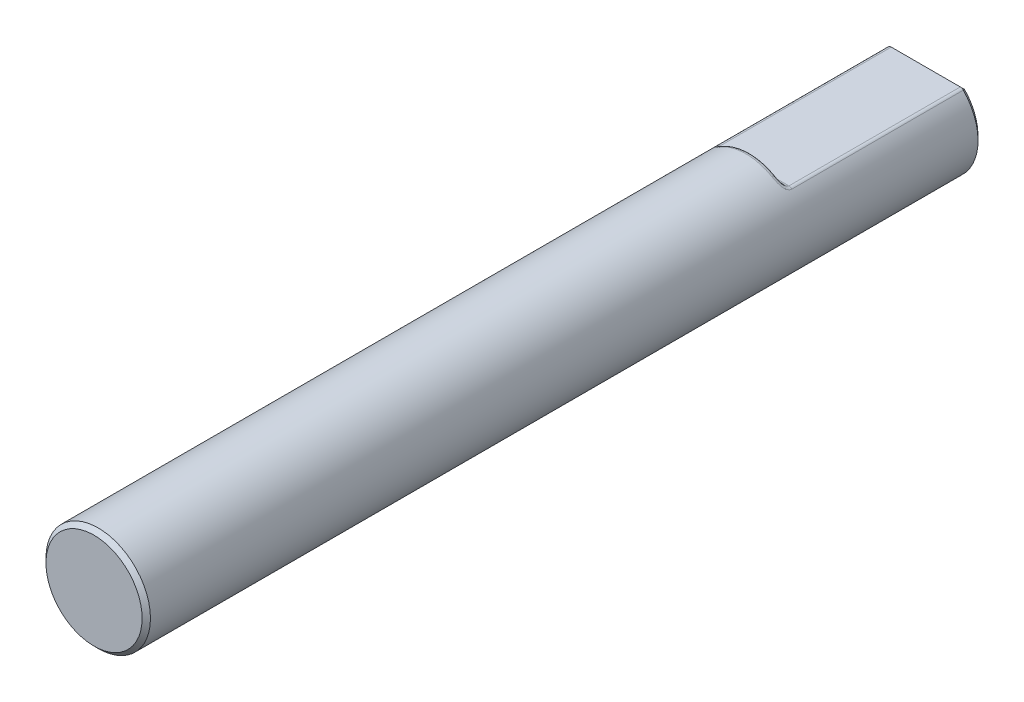
ISO-10303-21;
HEADER;
FILE_DESCRIPTION(('STEP AP214'),'2;1');
FILE_NAME('part.step','',(''),(''),'','','');
FILE_SCHEMA(('AUTOMOTIVE_DESIGN { 1 0 10303 214 1 1 1 1 }'));
ENDSEC;
DATA;
#1=APPLICATION_CONTEXT('core data for automotive mechanical design processes');
#2=APPLICATION_PROTOCOL_DEFINITION('international standard','automotive_design',2000,#1);
#3=PRODUCT_CONTEXT('',#1,'mechanical');
#4=PRODUCT('Part','Part','',(#3));
#5=PRODUCT_RELATED_PRODUCT_CATEGORY('part','',(#4));
#6=PRODUCT_DEFINITION_FORMATION('','',#4);
#7=PRODUCT_DEFINITION_CONTEXT('part definition',#1,'design');
#8=PRODUCT_DEFINITION('design','',#6,#7);
#9=PRODUCT_DEFINITION_SHAPE('','',#8);
#10=(LENGTH_UNIT() NAMED_UNIT(*) SI_UNIT(.MILLI.,.METRE.));
#11=(NAMED_UNIT(*) PLANE_ANGLE_UNIT() SI_UNIT($,.RADIAN.));
#12=(NAMED_UNIT(*) SI_UNIT($,.STERADIAN.) SOLID_ANGLE_UNIT());
#13=UNCERTAINTY_MEASURE_WITH_UNIT(LENGTH_MEASURE(1.E-05),#10,'distance_accuracy_value','');
#14=(GEOMETRIC_REPRESENTATION_CONTEXT(3) GLOBAL_UNCERTAINTY_ASSIGNED_CONTEXT((#13)) GLOBAL_UNIT_ASSIGNED_CONTEXT((#10,
#11,#12)) REPRESENTATION_CONTEXT('',''));
#15=CARTESIAN_POINT('',(0.,0.,0.));
#16=DIRECTION('',(0.,0.,1.));
#17=DIRECTION('',(1.,0.,0.));
#18=AXIS2_PLACEMENT_3D('',#15,#16,#17);
#19=CARTESIAN_POINT('',(0.,0.,50.8));
#20=DIRECTION('',(0.,0.,-1.));
#21=DIRECTION('',(-1.,0.,0.));
#22=AXIS2_PLACEMENT_3D('',#19,#20,#21);
#23=CYLINDRICAL_SURFACE('',#22,3.175);
#24=CARTESIAN_POINT('',(0.,0.,0.254000000000004));
#25=DIRECTION('',(0.,0.,1.));
#26=DIRECTION('',(1.,0.,0.));
#27=AXIS2_PLACEMENT_3D('',#24,#25,#26);
#28=CIRCLE('',#27,3.175);
#29=CARTESIAN_POINT('',(-2.28085258534348,2.20869565217391,0.254000000000004));
#30=VERTEX_POINT('',#29);
#31=CARTESIAN_POINT('',(2.28085258534348,2.20869565217391,0.254000000000004));
#32=VERTEX_POINT('',#31);
#33=EDGE_CURVE('E129',#30,#32,#28,.T.);
#34=ORIENTED_EDGE('',*,*,#33,.T.);
#35=DIRECTION('',(0.,0.,-1.));
#36=VECTOR('',#35,1.);
#37=CARTESIAN_POINT('',(2.28085258534348,2.20869565217391,50.8));
#38=LINE('',#37,#36);
#39=CARTESIAN_POINT('',(2.28085258534348,2.20869565217391,10.668));
#40=VERTEX_POINT('',#39);
#41=EDGE_CURVE('E229',#32,#40,#38,.F.);
#42=ORIENTED_EDGE('',*,*,#41,.T.);
#43=CARTESIAN_POINT('',(2.08147708691296,2.29465776440921,10.6022490499284));
#44=CARTESIAN_POINT('',(2.18936386379474,2.3017755032168,10.5756900123859));
#45=CARTESIAN_POINT('',(2.26247509447061,2.22751687915046,10.5364980998569));
#46=CARTESIAN_POINT('',(2.08704213800368,2.29182579741401,10.6127352009054));
#47=CARTESIAN_POINT('',(2.19483382835522,2.29661405397611,10.5902415242961));
#48=CARTESIAN_POINT('',(2.2685240630427,2.22136042915325,10.557470401812));
#49=CARTESIAN_POINT('',(2.09127161059837,2.28966018443801,10.6235854112991));
#50=CARTESIAN_POINT('',(2.19899567678026,2.29266629177763,10.6054541841004));
#51=CARTESIAN_POINT('',(2.2731213158654,2.21665257486143,10.5791708225988));
#52=CARTESIAN_POINT('',(2.09693841074738,2.28674969284816,10.6456238485392));
#53=CARTESIAN_POINT('',(2.20456628068673,2.28736847128426,10.6364319540538));
#54=CARTESIAN_POINT('',(2.27928088124954,2.21032541923893,10.6232476970779));
#55=CARTESIAN_POINT('',(2.09838256951604,2.28600133837143,10.6568111798799));
#56=CARTESIAN_POINT('',(2.20599150026584,2.28600284201359,10.6522216219));
#57=CARTESIAN_POINT('',(2.28085061904393,2.20869856168462,10.6456223597587));
#58=CARTESIAN_POINT('',(2.09838619099479,2.2859986590548,10.6792103368978));
#59=CARTESIAN_POINT('',(2.2059961718689,2.28599715252333,10.6838087081969));
#60=CARTESIAN_POINT('',(2.28085455542436,2.20869273706804,10.6904206737969));
#61=CARTESIAN_POINT('',(2.09694010091918,2.28674721009179,10.6904221683066));
#62=CARTESIAN_POINT('',(2.20457015007853,2.2873623338206,10.6996346421608));
#63=CARTESIAN_POINT('',(2.27928271837372,2.21032002191199,10.7128443366173));
#64=CARTESIAN_POINT('',(2.09124508751864,2.28967543925533,10.7124646912369));
#65=CARTESIAN_POINT('',(2.19896732211511,2.29269574713314,10.7306144268907));
#66=CARTESIAN_POINT('',(2.27309248644999,2.21668573753827,10.7569293824697));
#67=CARTESIAN_POINT('',(2.08699720571866,2.29185458557769,10.7232955228144));
#68=CARTESIAN_POINT('',(2.19478164244558,2.29667240400907,10.7457947946078));
#69=CARTESIAN_POINT('',(2.26847522366919,2.22142301222448,10.7785910456132));
#70=CARTESIAN_POINT('',(2.07595044465018,2.2974642569809,10.7442187468032));
#71=CARTESIAN_POINT('',(2.18392059477765,2.3069026139896,10.7748934919265));
#72=CARTESIAN_POINT('',(2.25646787455811,2.23361794985989,10.8204374936219));
#73=CARTESIAN_POINT('',(2.06916417277795,2.30088859527619,10.7543144988638));
#74=CARTESIAN_POINT('',(2.17723960723695,2.31316155570918,10.7888379839697));
#75=CARTESIAN_POINT('',(2.24909149192047,2.24106216327694,10.8406289977851));
#76=CARTESIAN_POINT('',(2.0533390852713,2.30876903921047,10.773628356883));
#77=CARTESIAN_POINT('',(2.16169366957577,2.32756298714666,10.8152092608687));
#78=CARTESIAN_POINT('',(2.23189030987301,2.25819356319842,10.8792567137962));
#79=CARTESIAN_POINT('',(2.04429730681642,2.31322650140487,10.7828452862371));
#80=CARTESIAN_POINT('',(2.15280269495554,2.33572867882211,10.8276462834935));
#81=CARTESIAN_POINT('',(2.22206229000665,2.2678836987371,10.8976905724349));
#82=CARTESIAN_POINT('',(2.02098081459409,2.32454002169663,10.8031634616703));
#83=CARTESIAN_POINT('',(2.1298989593879,2.35648115888799,10.8546466238543));
#84=CARTESIAN_POINT('',(2.19671827674762,2.29247830799507,10.938326923393));
#85=CARTESIAN_POINT('',(2.00596415863645,2.33170199441288,10.813881232634));
#86=CARTESIAN_POINT('',(2.1151434144868,2.36965333032366,10.8685247619315));
#87=CARTESIAN_POINT('',(2.18039582431238,2.30804781321404,10.9597624655657));
#88=CARTESIAN_POINT('',(1.97326577194165,2.34691281321471,10.8334930249975));
#89=CARTESIAN_POINT('',(2.08311483966224,2.39764310925851,10.8931020085138));
#90=CARTESIAN_POINT('',(2.14485409958122,2.34111481049926,10.9989860503166));
#91=CARTESIAN_POINT('',(1.95558163307324,2.35496245888326,10.8423853811602));
#92=CARTESIAN_POINT('',(2.06577703049759,2.41251048062678,10.9037877300662));
#93=CARTESIAN_POINT('',(2.12563220975182,2.35861404079051,11.0167707624204));
#94=CARTESIAN_POINT('',(1.91032606273425,2.37500469820587,10.8618052326057));
#95=CARTESIAN_POINT('',(2.02141535496309,2.44966648524454,10.9260146682914));
#96=CARTESIAN_POINT('',(2.07644137269369,2.40218412690304,11.0556104650698));
#97=CARTESIAN_POINT('',(1.88170767927852,2.38724120258011,10.8714671427826));
#98=CARTESIAN_POINT('',(1.99339768762638,2.47241543279391,10.9359028621589));
#99=CARTESIAN_POINT('',(2.04533443404104,2.4287852231007,11.0749342855267));
#100=CARTESIAN_POINT('',(1.82145126386168,2.41193885149924,10.8878579904839));
#101=CARTESIAN_POINT('',(1.93465543768717,2.51841820597802,10.9503739619204));
#102=CARTESIAN_POINT('',(1.97983833024153,2.48247576402772,11.1077159810065));
#103=CARTESIAN_POINT('',(1.78979611129448,2.42440090432795,10.8945689447679));
#104=CARTESIAN_POINT('',(1.90377328533236,2.54174707416492,10.9548168710213));
#105=CARTESIAN_POINT('',(1.94543055574109,2.50956718328915,11.1211378895483));
#106=CARTESIAN_POINT('',(1.70409217638077,2.45666350882904,10.9089348463087));
#107=CARTESIAN_POINT('',(1.81979372229936,2.60279896998063,10.960526783035));
#108=CARTESIAN_POINT('',(1.85227410478405,2.57970328011575,11.1498696925971));
#109=CARTESIAN_POINT('',(1.64833733543608,2.47621882415351,10.9145911135186));
#110=CARTESIAN_POINT('',(1.76548834456065,2.63980149990928,10.9576094400363));
#111=CARTESIAN_POINT('',(1.79167101678277,2.62221483512674,11.1611822270332));
#112=CARTESIAN_POINT('',(1.56287100562141,2.50397956699597,10.9196032814114));
#113=CARTESIAN_POINT('',(1.68382821837137,2.69197404713464,10.9467039697256));
#114=CARTESIAN_POINT('',(1.69877283219501,2.68256427607308,11.1712065628248));
#115=CARTESIAN_POINT('',(1.53434399991067,2.51289692220619,10.9207005582209));
#116=CARTESIAN_POINT('',(1.65623483168212,2.7090034987996,10.941891607098));
#117=CARTESIAN_POINT('',(1.66776521729313,2.70194983088047,11.1734011164429));
#118=CARTESIAN_POINT('',(1.47671654123674,2.5302250521972,10.921959105407));
#119=CARTESIAN_POINT('',(1.60056792251028,2.74223967470831,10.9302836248005));
#120=CARTESIAN_POINT('',(1.6051266752584,2.73961967869211,11.1759182108129));
#121=CARTESIAN_POINT('',(1.44761812910635,2.53863730506082,10.9221232532304));
#122=CARTESIAN_POINT('',(1.57245677980513,2.75844154181662,10.9234337887686));
#123=CARTESIAN_POINT('',(1.5734979664221,2.75790718491991,11.1762465064588));
#124=CARTESIAN_POINT('',(1.41823541644457,2.54679768400697,10.9219090220771));
#125=CARTESIAN_POINT('',(1.54451470751985,2.774006261644,10.9158261656988));
#126=CARTESIAN_POINT('',(1.54156023526584,2.7756471391456,11.1758180441542));
#127=(BOUNDED_SURFACE() B_SPLINE_SURFACE(3,2,((#43,#44,#45),(#46,#47,#48),(#49,#50,#51),(#52,
#53,#54),(#55,#56,#57),(#58,#59,#60),(#61,#62,#63),(#64,#65,#66),(#67,#68,#69),(#70,#71,#72),
(#73,#74,#75),(#76,#77,#78),(#79,#80,#81),(#82,#83,#84),(#85,#86,#87),(#88,#89,#90),(#91,#92,
#93),(#94,#95,#96),(#97,#98,#99),(#100,#101,#102),(#103,#104,#105),(#106,#107,#108),(#109,#110,
#111),(#112,#113,#114),(#115,#116,#117),(#118,#119,#120),(#121,#122,#123),(#124,#125,#126)),
.UNSPECIFIED.,.F.,.F.,.F.) B_SPLINE_SURFACE_WITH_KNOTS((4,2,2,2,2,2,2,2,2,2,2,2,2,4),(3,3),(0.,
0.0672104314705853,0.134255813086062,0.201430127025273,0.26857948396257,0.335399666159644,
0.402308089484164,0.491321385718032,0.580415527083602,0.706679723053762,0.833703060250032,
1.03955425802727,1.14065716571275,1.24144813718876),(0.,1.),
.UNSPECIFIED.) GEOMETRIC_REPRESENTATION_ITEM() RATIONAL_B_SPLINE_SURFACE(((1.,0.9158783432604,
1.),(1.,0.91749680132151,1.),(1.,0.918721732551247,1.),(1.,0.920359514561852,1.),(1.,
0.92077435219615,1.),(1.,0.920775090647766,1.),(1.,0.920359395835313,1.),(1.,0.91871468096907,
1.),(1.,0.917485963144106,1.),(1.,0.914268823994684,1.),(1.,0.912284156361139,1.),(1.,
0.907617155420817,1.),(1.,0.904933904254616,1.),(1.,0.897949439882381,1.),(1.,0.89340656300735,
1.),(1.,0.883384768646523,1.),(1.,0.877905004761794,1.),(1.,0.863707190237002,1.),(1.,
0.854591910951541,1.),(1.,0.835110248016913,1.),(1.,0.824736671822701,1.),(1.,0.796321963359922,
1.),(1.,0.777517554435384,1.),(1.,0.748410149790813,1.),(1.,0.738650250939946,1.),(1.,
0.718888204715718,1.),(1.,0.708886897667141,1.),(1.,0.69878597142492,1.))) REPRESENTATION_ITEM('') SURFACE());
#128=CARTESIAN_POINT('',(1.54156023526584,2.7756471391456,11.1758180441542));
#129=CARTESIAN_POINT('',(1.5734979664221,2.75790718491991,11.1762465064588));
#130=CARTESIAN_POINT('',(1.6051266752584,2.73961967869211,11.1759182108129));
#131=CARTESIAN_POINT('',(1.66776521729313,2.70194983088047,11.1734011164429));
#132=CARTESIAN_POINT('',(1.69877283219501,2.68256427607308,11.1712065628248));
#133=CARTESIAN_POINT('',(1.79167101678277,2.62221483512674,11.1611822270332));
#134=CARTESIAN_POINT('',(1.85227410478405,2.57970328011575,11.1498696925971));
#135=CARTESIAN_POINT('',(1.94543055574109,2.50956718328915,11.1211378895483));
#136=CARTESIAN_POINT('',(1.97983833024153,2.48247576402772,11.1077159810065));
#137=CARTESIAN_POINT('',(2.04533443404104,2.4287852231007,11.0749342855267));
#138=CARTESIAN_POINT('',(2.07644137269369,2.40218412690304,11.0556104650698));
#139=CARTESIAN_POINT('',(2.12563220975182,2.35861404079051,11.0167707624204));
#140=CARTESIAN_POINT('',(2.14485409958122,2.34111481049926,10.9989860503166));
#141=CARTESIAN_POINT('',(2.18039582431238,2.30804781321404,10.9597624655657));
#142=CARTESIAN_POINT('',(2.19671827674762,2.29247830799507,10.938326923393));
#143=CARTESIAN_POINT('',(2.22206229000665,2.2678836987371,10.8976905724349));
#144=CARTESIAN_POINT('',(2.23189030987301,2.25819356319842,10.8792567137962));
#145=CARTESIAN_POINT('',(2.24909149192047,2.24106216327694,10.8406289977851));
#146=CARTESIAN_POINT('',(2.25646787455811,2.23361794985989,10.8204374936219));
#147=CARTESIAN_POINT('',(2.26847522366919,2.22142301222448,10.7785910456132));
#148=CARTESIAN_POINT('',(2.27309248644999,2.21668573753827,10.7569293824697));
#149=CARTESIAN_POINT('',(2.27928271837372,2.21032002191199,10.7128443366173));
#150=CARTESIAN_POINT('',(2.28085455542436,2.20869273706804,10.6904206737969));
#151=CARTESIAN_POINT('',(2.28085061904392,2.20869856168462,10.6456223597587));
#152=CARTESIAN_POINT('',(2.27928088124954,2.21032541923893,10.6232476970779));
#153=CARTESIAN_POINT('',(2.27312131586541,2.21665257486143,10.5791708225988));
#154=CARTESIAN_POINT('',(2.2685240630427,2.22136042915325,10.557470401812));
#155=CARTESIAN_POINT('',(2.26247509447061,2.22751687915046,10.5364980998569));
#156=B_SPLINE_CURVE_WITH_KNOTS('',3,(#128,#129,#130,#131,#132,#133,#134,#135,#136,#137,#138,
#139,#140,#141,#142,#143,#144,#145,#146,#147,#148,#149,#150,#151,#152,#153,#154,#155),
.UNSPECIFIED.,.F.,.F.,(4,2,2,2,2,2,2,2,2,2,2,2,2,4),(0.,0.100790971476017,0.201893879161491,
0.407745076938732,0.534768414135002,0.661032610105162,0.750126751470732,0.8391400477046,
0.90604847102912,0.972868653226194,1.04001801016349,1.1071923241027,1.17423770571818,
1.24144813718876),.UNSPECIFIED.);
#157=CARTESIAN_POINT('',(1.56787252156188,2.76086956521513,11.176));
#158=VERTEX_POINT('',#157);
#159=EDGE_CURVE('E240',#158,#40,#156,.T.);
#160=ORIENTED_EDGE('',*,*,#159,.F.);
#161=CARTESIAN_POINT('',(0.,0.,11.176));
#162=DIRECTION('',(0.,0.,-1.));
#163=DIRECTION('',(-1.,0.,0.));
#164=AXIS2_PLACEMENT_3D('',#161,#162,#163);
#165=CIRCLE('',#164,3.175);
#166=CARTESIAN_POINT('',(-1.56787252156188,2.76086956521513,11.176));
#167=VERTEX_POINT('',#166);
#168=EDGE_CURVE('E285',#158,#167,#165,.F.);
#169=ORIENTED_EDGE('',*,*,#168,.T.);
#170=CARTESIAN_POINT('',(-0.762299234663434,2.67988837118684,10.8800076498778));
#171=CARTESIAN_POINT('',(-0.808454571196122,2.79883353609913,10.8015244187787));
#172=CARTESIAN_POINT('',(-0.830789738447543,2.92858721756073,10.8729597557011));
#173=CARTESIAN_POINT('',(-0.853124905698965,3.05834089902232,10.9443950926236));
#174=CARTESIAN_POINT('',(-0.828586124634168,3.0649747199714,11.0920152997555));
#175=CARTESIAN_POINT('',(-0.820250640114377,2.67205322069554,10.8851771222936));
#176=CARTESIAN_POINT('',(-0.867400480829563,2.79068636588262,10.8131719532479));
#177=CARTESIAN_POINT('',(-0.891541388471028,2.91580560722968,10.8856211442746));
#178=CARTESIAN_POINT('',(-0.914941398498865,3.04107868495901,10.9578892221924));
#179=CARTESIAN_POINT('',(-0.891576782731473,3.0479417841744,11.1023542448926));
#180=CARTESIAN_POINT('',(-0.877755361083727,2.66332341056633,10.8903129678));
#181=CARTESIAN_POINT('',(-0.92592877967618,2.78124472770227,10.8250620211124));
#182=CARTESIAN_POINT('',(-0.951425199159079,2.90151226555305,10.8983450372317));
#183=CARTESIAN_POINT('',(-0.976208377398107,3.02196998343128,10.9714725289282));
#184=CARTESIAN_POINT('',(-0.954081914220675,3.02896393604052,11.1126259357527));
#185=CARTESIAN_POINT('',(-0.991969683185946,2.64403509309197,10.8999690081169));
#186=CARTESIAN_POINT('',(-1.04169258045847,2.75960112540079,10.8482913709519));
#187=CARTESIAN_POINT('',(-1.06978127919812,2.86978499003571,10.9229611074155));
#188=CARTESIAN_POINT('',(-1.09718697316803,2.98015295286698,10.9974959142075));
#189=CARTESIAN_POINT('',(-1.07822791650723,2.98703281104265,11.1319380160807));
#190=CARTESIAN_POINT('',(-1.04867563922458,2.63347006104244,10.9044868998619));
#191=CARTESIAN_POINT('',(-1.09892243011284,2.74742454904997,10.8596318802492));
#192=CARTESIAN_POINT('',(-1.1282476339339,2.85233984149462,10.9348500970331));
#193=CARTESIAN_POINT('',(-1.1568943391921,2.95747962491751,11.0099416324129));
#194=CARTESIAN_POINT('',(-1.13986482524564,2.96406535003871,11.1409737994176));
#195=CARTESIAN_POINT('',(-1.16252815317474,2.61021004410484,10.9124215598666));
#196=CARTESIAN_POINT('',(-1.21352270951136,2.71979486388968,10.8811216260847));
#197=CARTESIAN_POINT('',(-1.24525649462567,2.8137550790047,10.9570370828334));
#198=CARTESIAN_POINT('',(-1.27627345706398,2.90795091162972,11.0328146121703));
#199=CARTESIAN_POINT('',(-1.26361755779691,2.91350009593807,11.1568431200567));
#200=CARTESIAN_POINT('',(-1.21964318194118,2.59746403821029,10.9158042486044));
#201=CARTESIAN_POINT('',(-1.27089237949075,2.704290954553,10.8912515754067));
#202=CARTESIAN_POINT('',(-1.30375598717389,2.79252628821361,10.9672816999427));
#203=CARTESIAN_POINT('',(-1.3359415550085,2.88103105583919,11.043209544924));
#204=CARTESIAN_POINT('',(-1.32569911079975,2.88579138761451,11.1636084983411));
#205=CARTESIAN_POINT('',(-1.33231038345131,2.57010599024989,10.9205910853952));
#206=CARTESIAN_POINT('',(-1.38386175957636,2.67019756054878,10.9088647282834));
#207=CARTESIAN_POINT('',(-1.41890340532494,2.74677756787298,10.9845746179531));
#208=CARTESIAN_POINT('',(-1.45327945016235,2.82362197790151,11.0601849922841));
#209=CARTESIAN_POINT('',(-1.44816346026832,2.82631737031352,11.1731821719086));
#210=CARTESIAN_POINT('',(-1.38786509293675,2.55549722008799,10.921998651877));
#211=CARTESIAN_POINT('',(-1.43950163114539,2.65164383103817,10.9163855501474));
#212=CARTESIAN_POINT('',(-1.47555436381539,2.72226340524148,10.9916284269442));
#213=CARTESIAN_POINT('',(-1.51099307671079,2.79317145232893,11.0668184745863));
#214=CARTESIAN_POINT('',(-1.50854901406201,2.79455917417128,11.1759973040521));
#215=CARTESIAN_POINT('',(-1.50112496213681,2.52333728166747,10.9220014495112));
#216=CARTESIAN_POINT('',(-1.55275280667336,2.61006022987343,10.9279682739116));
#217=CARTESIAN_POINT('',(-1.59089564996183,2.668131553955,11.0015197983011));
#218=CARTESIAN_POINT('',(-1.62833652349757,2.72653200495786,11.0750113068408));
#219=CARTESIAN_POINT('',(-1.63165756753965,2.72464626442251,11.1760028987021));
#220=CARTESIAN_POINT('',(-1.55867762864259,2.50564745309275,10.9203772122655));
#221=CARTESIAN_POINT('',(-1.61031457931399,2.58680457404335,10.9317871027363));
#222=CARTESIAN_POINT('',(-1.64941892987043,2.63826869890692,11.004000372813));
#223=CARTESIAN_POINT('',(-1.68790679925395,2.69007454522406,11.0762278826761));
#224=CARTESIAN_POINT('',(-1.69421481373488,2.68619011535732,11.1727544244942));
#225=CARTESIAN_POINT('',(-1.67001075069184,2.46871777282755,10.9125184534406));
#226=CARTESIAN_POINT('',(-1.72156336376832,2.53756082977369,10.9329348511462));
#227=CARTESIAN_POINT('',(-1.76254681505414,2.57579500199805,11.0014171831576));
#228=CARTESIAN_POINT('',(-1.8029353562413,2.61435645497089,11.0699129396472));
#229=CARTESIAN_POINT('',(-1.81522907684596,2.60590820186022,11.1570369069177));
#230=CARTESIAN_POINT('',(-1.72381835712975,2.44949187849227,10.9063219907653));
#231=CARTESIAN_POINT('',(-1.77536532155225,2.51160468414136,10.9303850677406));
#232=CARTESIAN_POINT('',(-1.81717971105311,2.54320880313272,10.9964153509943));
#233=CARTESIAN_POINT('',(-1.85851445504863,2.57511890165557,11.0625418994872));
#234=CARTESIAN_POINT('',(-1.87371560560339,2.56411277950396,11.1446439813612));
#235=CARTESIAN_POINT('',(-1.80292276077018,2.41923540582102,10.891767117344));
#236=CARTESIAN_POINT('',(-1.85454874796133,2.47031526978128,10.9194783522161));
#237=CARTESIAN_POINT('',(-1.89748038044137,2.49188332340885,10.980630906568));
#238=CARTESIAN_POINT('',(-1.94026600216108,2.51354502621428,11.0418110795954));
#239=CARTESIAN_POINT('',(-1.9596986529959,2.49833783864622,11.1155342347813));
#240=CARTESIAN_POINT('',(-1.83014752530398,2.40841285672401,10.885638641317));
#241=CARTESIAN_POINT('',(-1.88175783307414,2.45550250616874,10.9142830817489));
#242=CARTESIAN_POINT('',(-1.92511335621934,2.4735161861718,10.9734655380533));
#243=CARTESIAN_POINT('',(-1.96834795691031,2.49161288642991,11.0326880012796));
#244=CARTESIAN_POINT('',(-1.98929078832904,2.47481055781944,11.1032772829337));
#245=CARTESIAN_POINT('',(-1.88232889275729,2.38694093196964,10.8711232079258));
#246=CARTESIAN_POINT('',(-1.93389174398979,2.42601660470123,10.9007551317029));
#247=CARTESIAN_POINT('',(-1.97807707677935,2.43707121107891,10.95548564907));
#248=CARTESIAN_POINT('',(-2.02214167440272,2.44820908384398,11.0102581914785));
#249=CARTESIAN_POINT('',(-2.04600966598014,2.42813246050803,11.0742464161555));
#250=CARTESIAN_POINT('',(-1.90728581104324,2.37629153240375,10.8627365652268));
#251=CARTESIAN_POINT('',(-1.95884121824672,2.41133491965082,10.8924335155079));
#252=CARTESIAN_POINT('',(-2.00340814166487,2.41899333328762,10.9446716369701));
#253=CARTESIAN_POINT('',(-2.04787893216272,2.42672364611375,10.9969650373091));
#254=CARTESIAN_POINT('',(-2.07313675108772,2.4049815920483,11.0574731305553));
#255=CARTESIAN_POINT('',(-1.96885567046095,2.3491613790481,10.8371764972169));
#256=CARTESIAN_POINT('',(-2.02030174315196,2.37389199009283,10.8657309595062));
#257=CARTESIAN_POINT('',(-2.06590808978146,2.3729475380562,10.9105966768575));
#258=CARTESIAN_POINT('',(-2.11127065449561,2.37218095561986,10.955590682134));
#259=CARTESIAN_POINT('',(-2.14006051144552,2.34600299814739,11.0063529942691));
#260=CARTESIAN_POINT('',(-2.00309524629659,2.33316136080688,10.8177796496598));
#261=CARTESIAN_POINT('',(-2.05459496014833,2.35165349977411,10.8442867124251));
#262=CARTESIAN_POINT('',(-2.10067240156119,2.34580125726829,10.8837758682522));
#263=CARTESIAN_POINT('',(-2.14663147669669,2.34004318136349,10.9234014225315));
#264=CARTESIAN_POINT('',(-2.17727744186083,2.31122034994011,10.9675592992545));
#265=CARTESIAN_POINT('',(-2.0412845363251,2.31470629260322,10.7857659371126));
#266=CARTESIAN_POINT('',(-2.09283528964189,2.3259702817812,10.8075075874998));
#267=CARTESIAN_POINT('',(-2.13945748215966,2.3145098245304,10.8384188179936));
#268=CARTESIAN_POINT('',(-2.18606009283279,2.303065688487,10.8693537440218));
#269=CARTESIAN_POINT('',(-2.21878753939152,2.27110063595206,10.9035318742508));
#270=CARTESIAN_POINT('',(-2.05101801474579,2.30991767225333,10.7761604686422));
#271=CARTESIAN_POINT('',(-2.10257490865864,2.31930636558034,10.7963589161379));
#272=CARTESIAN_POINT('',(-2.14934427852263,2.30639321366069,10.8247071273591));
#273=CARTESIAN_POINT('',(-2.1961020580726,2.29348979396539,10.8530749739705));
#274=CARTESIAN_POINT('',(-2.22936740708671,2.26069059149311,10.8843209373304));
#275=CARTESIAN_POINT('',(-2.06800792883518,2.30147010591433,10.755968541626));
#276=CARTESIAN_POINT('',(-2.11957065181777,2.30755026745252,10.7727270000238));
#277=CARTESIAN_POINT('',(-2.16660345219586,2.29207800676935,10.7957210648044));
#278=CARTESIAN_POINT('',(-2.21362517623187,2.27661481461511,10.8187335625273));
#279=CARTESIAN_POINT('',(-2.24783470502556,2.2423263168695,10.8439370832904));
#280=CARTESIAN_POINT('',(-2.07527023134683,2.29780848630495,10.7453844834897));
#281=CARTESIAN_POINT('',(-2.12683924341141,2.30245000141317,10.7602441045373));
#282=CARTESIAN_POINT('',(-2.17398178483748,2.28587487126957,10.7804505075622));
#283=CARTESIAN_POINT('',(-2.22111918440745,2.26930404918142,10.8006708542938));
#284=CARTESIAN_POINT('',(-2.25572851227165,2.23436627448576,10.8227689669896));
#285=CARTESIAN_POINT('',(-2.08701515077473,2.29184663362126,10.7233781030269));
#286=CARTESIAN_POINT('',(-2.13859025700275,2.29414738585099,10.7341569930664));
#287=CARTESIAN_POINT('',(-2.18591518684787,2.27577662976745,10.7485886720305));
#288=CARTESIAN_POINT('',(-2.23323460153265,2.25741058404312,10.7630348598544));
#289=CARTESIAN_POINT('',(-2.26849472916527,2.22140572535448,10.7787562060434));
#290=CARTESIAN_POINT('',(-2.09147735730913,2.28955640223636,10.7119502890808));
#291=CARTESIAN_POINT('',(-2.14305743849332,2.29095535739497,10.7205403703218));
#292=CARTESIAN_POINT('',(-2.1904495257441,2.2718984799112,10.7319886684787));
#293=CARTESIAN_POINT('',(-2.23784029717486,2.25284272813122,10.7434443525085));
#294=CARTESIAN_POINT('',(-2.27334495361359,2.21642696140777,10.7559005781588));
#295=CARTESIAN_POINT('',(-2.09727971817923,2.28657216458006,10.6886839029537));
#296=CARTESIAN_POINT('',(-2.14886373905382,2.28679772458579,10.6927571114714));
#297=CARTESIAN_POINT('',(-2.19634581524727,2.26684541527033,10.6981379073875));
#298=CARTESIAN_POINT('',(-2.24382663418924,2.24689418534878,10.7035260894739));
#299=CARTESIAN_POINT('',(-2.2796518675694,2.20993948819315,10.7093678059102));
#300=CARTESIAN_POINT('',(-2.09861909174009,2.28587855749934,10.6768452287996));
#301=CARTESIAN_POINT('',(-2.15020481174799,2.28583072383518,10.6785840199393));
#302=CARTESIAN_POINT('',(-2.1977069724911,2.26567117652205,10.6808869882008));
#303=CARTESIAN_POINT('',(-2.24520928976181,2.24551150026103,10.6831890489175));
#304=CARTESIAN_POINT('',(-2.28110770840861,2.20843164673108,10.6856904576));
#305=CARTESIAN_POINT('',(-2.0981122219295,2.28614074727929,10.6545276907655));
#306=CARTESIAN_POINT('',(-2.14969741457079,2.28619617334504,10.6518783800826));
#307=CARTESIAN_POINT('',(-2.1971918663475,2.26611506720477,10.64837144871));
#308=CARTESIAN_POINT('',(-2.24468616058591,2.24603409154302,10.6448641628803));
#309=CARTESIAN_POINT('',(-2.28055676297087,2.20900162452606,10.6410553815303));
#310=CARTESIAN_POINT('',(-2.09660336787585,2.28692185698689,10.6440438789613));
#311=CARTESIAN_POINT('',(-2.14818658730501,2.28728520752625,10.6393333810272));
#312=CARTESIAN_POINT('',(-2.19565847877923,2.26743745889233,10.633099081964));
#313=CARTESIAN_POINT('',(-2.24312848768112,2.24759130952152,10.6268589872155));
#314=CARTESIAN_POINT('',(-2.27891670421489,2.21069968910487,10.6200877579223));
#315=CARTESIAN_POINT('',(-2.09114296873868,2.28972640646082,10.6233920303546));
#316=CARTESIAN_POINT('',(-2.14272331737759,2.29119179996325,10.6146779204575));
#317=CARTESIAN_POINT('',(-2.19010976434906,2.27218641859128,10.6030571597748));
#318=CARTESIAN_POINT('',(-2.23749581402249,2.25318138924119,10.5914298437462));
#319=CARTESIAN_POINT('',(-2.27298148775742,2.21679653578144,10.5787840607095));
#320=CARTESIAN_POINT('',(-2.08718836119378,2.29175140374508,10.6132244062582));
#321=CARTESIAN_POINT('',(-2.13876579552078,2.2940129611686,10.6025636404885));
#322=CARTESIAN_POINT('',(-2.18609132581973,2.27561562462426,10.5882882592501));
#323=CARTESIAN_POINT('',(-2.23341557657331,2.25721941030214,10.574000316868));
#324=CARTESIAN_POINT('',(-2.26868300129355,2.22119870378776,10.5584488125171));
#325=CARTESIAN_POINT('',(-2.08206194010851,2.29436066372538,10.6033678371508));
#326=CARTESIAN_POINT('',(-2.13363712020501,2.29764660609158,10.5908793690834));
#327=CARTESIAN_POINT('',(-2.18088249321621,2.28003493000732,10.5740133663434));
#328=CARTESIAN_POINT('',(-2.22812786622741,2.26242325392307,10.5571473636033));
#329=CARTESIAN_POINT('',(-2.26311080446577,2.22687100809865,10.5387356743016));
#330=(BOUNDED_SURFACE() B_SPLINE_SURFACE(3,2,((#170,#171,#172,#173,#174),(#175,#176,#177,#178,
#179),(#180,#181,#182,#183,#184),(#185,#186,#187,#188,#189),(#190,#191,#192,#193,#194),(#195,
#196,#197,#198,#199),(#200,#201,#202,#203,#204),(#205,#206,#207,#208,#209),(#210,#211,#212,#213,
#214),(#215,#216,#217,#218,#219),(#220,#221,#222,#223,#224),(#225,#226,#227,#228,#229),(#230,
#231,#232,#233,#234),(#235,#236,#237,#238,#239),(#240,#241,#242,#243,#244),(#245,#246,#247,#248,
#249),(#250,#251,#252,#253,#254),(#255,#256,#257,#258,#259),(#260,#261,#262,#263,#264),(#265,
#266,#267,#268,#269),(#270,#271,#272,#273,#274),(#275,#276,#277,#278,#279),(#280,#281,#282,#283,
#284),(#285,#286,#287,#288,#289),(#290,#291,#292,#293,#294),(#295,#296,#297,#298,#299),(#300,
#301,#302,#303,#304),(#305,#306,#307,#308,#309),(#310,#311,#312,#313,#314),(#315,#316,#317,#318,
#319),(#320,#321,#322,#323,#324),(#325,#326,#327,#328,#329)),.UNSPECIFIED.,.F.,.F.,
.F.) B_SPLINE_SURFACE_WITH_KNOTS((4,2,2,2,2,2,2,2,2,2,2,2,2,2,2,4),(3,2,3),(0.,
0.182760510356747,0.366184603421325,0.554704723257799,0.742898159108683,0.945245044260013,
1.14592634182732,1.25624208984294,1.36654247381168,1.54526716009423,1.61571839776284,
1.6860011900331,1.75679050984165,1.8275975265927,1.89053789737151,1.95355723923478),(0.,0.5,1.),
.UNSPECIFIED.) GEOMETRIC_REPRESENTATION_ITEM() RATIONAL_B_SPLINE_SURFACE(((1.,0.861368967830898,
1.,0.861368967830898,1.),(1.,0.866288240625045,1.,0.866288240625045,1.),(1.,0.871371504214175,
1.,0.871371504214175,1.),(1.,0.881711065348493,1.,0.881711065348493,1.),(1.,0.886967924145989,
1.,0.886967924145989,1.),(1.,0.897607247982836,1.,0.897607247982836,1.),(1.,0.902989145037586,
1.,0.902989145037586,1.),(1.,0.913587249999423,1.,0.913587249999423,1.),(1.,0.918803728865734,
1.,0.918803728865734,1.),(1.,0.929337071732957,1.,0.929337071732957,1.),(1.,0.934631980562339,
1.,0.934631980562339,1.),(1.,0.94469272833093,1.,0.94469272833093,1.),(1.,0.949462563471401,1.,
0.949462563471401,1.),(1.,0.956308002129858,1.,0.956308002129858,1.),(1.,0.958629648131995,1.,
0.958629648131995,1.),(1.,0.963013582601352,1.,0.963013582601352,1.),(1.,0.965075907145138,1.,
0.965075907145138,1.),(1.,0.970080240778956,1.,0.970080240778956,1.),(1.,0.972774317554616,1.,
0.972774317554616,1.),(1.,0.975714987497997,1.,0.975714987497997,1.),(1.,0.976455547900149,1.,
0.976455547900149,1.),(1.,0.977738728864047,1.,0.977738728864047,1.),(1.,0.978281818456567,1.,
0.978281818456567,1.),(1.,0.979155768003715,1.,0.979155768003715,1.),(1.,0.979485070212517,1.,
0.979485070212517,1.),(1.,0.979912598367567,1.,0.979912598367567,1.),(1.,0.980010766525434,1.,
0.980010766525434,1.),(1.,0.97997358235551,1.,0.97997358235551,1.),(1.,0.979862962402858,1.,
0.979862962402858,1.),(1.,0.979460217950009,1.,0.979460217950009,1.),(1.,0.979167865890775,1.,
0.979167865890775,1.),(1.,0.978787165034222,1.,0.978787165034222,1.))) REPRESENTATION_ITEM('') SURFACE());
#331=CARTESIAN_POINT('',(-2.26311080446577,2.22687100809865,10.5387356743016));
#332=CARTESIAN_POINT('',(-2.26868300129355,2.22119870378776,10.5584488125171));
#333=CARTESIAN_POINT('',(-2.27298148775742,2.21679653578145,10.5787840607095));
#334=CARTESIAN_POINT('',(-2.27891670421489,2.21069968910487,10.6200877579223));
#335=CARTESIAN_POINT('',(-2.28055676297087,2.20900162452606,10.6410553815303));
#336=CARTESIAN_POINT('',(-2.28110770840861,2.20843164673108,10.6856904576));
#337=CARTESIAN_POINT('',(-2.2796518675694,2.20993948819315,10.7093678059102));
#338=CARTESIAN_POINT('',(-2.27334495361359,2.21642696140777,10.7559005781588));
#339=CARTESIAN_POINT('',(-2.26849472916527,2.22140572535448,10.7787562060434));
#340=CARTESIAN_POINT('',(-2.25572851227165,2.23436627448576,10.8227689669896));
#341=CARTESIAN_POINT('',(-2.24783470502556,2.2423263168695,10.8439370832904));
#342=CARTESIAN_POINT('',(-2.22936740708671,2.26069059149311,10.8843209373304));
#343=CARTESIAN_POINT('',(-2.21878753939152,2.27110063595206,10.9035318742508));
#344=CARTESIAN_POINT('',(-2.17727744186083,2.31122034994011,10.9675592992545));
#345=CARTESIAN_POINT('',(-2.14006051144552,2.34600299814739,11.0063529942691));
#346=CARTESIAN_POINT('',(-2.07313675108772,2.4049815920483,11.0574731305553));
#347=CARTESIAN_POINT('',(-2.04600966598014,2.42813246050803,11.0742464161555));
#348=CARTESIAN_POINT('',(-1.98929078832904,2.47481055781944,11.1032772829337));
#349=CARTESIAN_POINT('',(-1.9596986529959,2.49833783864623,11.1155342347813));
#350=CARTESIAN_POINT('',(-1.87371560560339,2.56411277950396,11.1446439813612));
#351=CARTESIAN_POINT('',(-1.81522907684596,2.60590820186022,11.1570369069177));
#352=CARTESIAN_POINT('',(-1.69421481373488,2.68619011535732,11.1727544244942));
#353=CARTESIAN_POINT('',(-1.63165756753965,2.72464626442251,11.1760028987021));
#354=CARTESIAN_POINT('',(-1.50854901406201,2.79455917417128,11.1759973040521));
#355=CARTESIAN_POINT('',(-1.44816346026832,2.82631737031352,11.1731821719086));
#356=CARTESIAN_POINT('',(-1.32569911079975,2.88579138761451,11.1636084983411));
#357=CARTESIAN_POINT('',(-1.26361755779691,2.91350009593807,11.1568431200567));
#358=CARTESIAN_POINT('',(-1.13986482524564,2.96406535003871,11.1409737994176));
#359=CARTESIAN_POINT('',(-1.07822791650723,2.98703281104265,11.1319380160807));
#360=CARTESIAN_POINT('',(-0.954081914220675,3.02896393604052,11.1126259357527));
#361=CARTESIAN_POINT('',(-0.891576782731473,3.0479417841744,11.1023542448926));
#362=CARTESIAN_POINT('',(-0.828586124634168,3.0649747199714,11.0920152997555));
#363=B_SPLINE_CURVE_WITH_KNOTS('',3,(#331,#332,#333,#334,#335,#336,#337,#338,#339,#340,#341,
#342,#343,#344,#345,#346,#347,#348,#349,#350,#351,#352,#353,#354,#355,#356,#357,#358,#359,#360,
#361,#362),.UNSPECIFIED.,.F.,.F.,(4,2,2,2,2,2,2,2,2,2,2,2,2,2,2,4),(0.,0.0630193418632715,
0.125959712642075,0.196766729393131,0.267556049201678,0.33783884147194,0.408290079140546,
0.587014765423097,0.697315149391833,0.80763089740746,1.00831219497476,1.21065908012609,
1.39885251597698,1.58737263581345,1.77079672887803,1.95355723923478),.UNSPECIFIED.);
#364=CARTESIAN_POINT('',(-2.28085258534348,2.20869565217391,10.668));
#365=VERTEX_POINT('',#364);
#366=EDGE_CURVE('E279',#365,#167,#363,.T.);
#367=ORIENTED_EDGE('',*,*,#366,.F.);
#368=DIRECTION('',(0.,0.,-1.));
#369=VECTOR('',#368,1.);
#370=CARTESIAN_POINT('',(-2.28085258534348,2.20869565217391,50.8));
#371=LINE('',#370,#369);
#372=EDGE_CURVE('E232',#365,#30,#371,.T.);
#373=ORIENTED_EDGE('',*,*,#372,.T.);
#374=EDGE_LOOP('',(#34,#42,#160,#169,#367,#373));
#375=FACE_BOUND('',#374,.T.);
#376=CARTESIAN_POINT('',(0.,0.,50.546));
#377=DIRECTION('',(0.,0.,1.));
#378=DIRECTION('',(1.,0.,0.));
#379=AXIS2_PLACEMENT_3D('',#376,#377,#378);
#380=CIRCLE('',#379,3.175);
#381=CARTESIAN_POINT('',(3.175,0.,50.546));
#382=VERTEX_POINT('',#381);
#383=EDGE_CURVE('E126',#382,#382,#380,.F.);
#384=ORIENTED_EDGE('',*,*,#383,.T.);
#385=EDGE_LOOP('',(#384));
#386=FACE_BOUND('',#385,.T.);
#387=ADVANCED_FACE('F38',(#375,#386),#23,.T.);
#388=CARTESIAN_POINT('',(0.,0.,50.8));
#389=DIRECTION('',(0.,0.,1.));
#390=DIRECTION('',(1.,0.,0.));
#391=AXIS2_PLACEMENT_3D('',#388,#389,#390);
#392=PLANE('',#391);
#393=CARTESIAN_POINT('',(0.,0.,50.8));
#394=DIRECTION('',(0.,0.,1.));
#395=DIRECTION('',(1.,0.,0.));
#396=AXIS2_PLACEMENT_3D('',#393,#394,#395);
#397=CIRCLE('',#396,2.921);
#398=CARTESIAN_POINT('',(2.921,0.,50.8));
#399=VERTEX_POINT('',#398);
#400=EDGE_CURVE('E135',#399,#399,#397,.T.);
#401=ORIENTED_EDGE('',*,*,#400,.T.);
#402=EDGE_LOOP('',(#401));
#403=FACE_BOUND('',#402,.T.);
#404=ADVANCED_FACE('F216',(#403),#392,.T.);
#405=CARTESIAN_POINT('',(0.,0.,0.));
#406=DIRECTION('',(0.,0.,1.));
#407=DIRECTION('',(1.,0.,0.));
#408=AXIS2_PLACEMENT_3D('',#405,#406,#407);
#409=PLANE('',#408);
#410=CARTESIAN_POINT('',(0.,0.,0.));
#411=DIRECTION('',(0.,0.,1.));
#412=DIRECTION('',(1.,0.,0.));
#413=AXIS2_PLACEMENT_3D('',#410,#411,#412);
#414=CIRCLE('',#413,2.92099999999999);
#415=CARTESIAN_POINT('',(2.09838437851603,2.03199999999996,0.));
#416=VERTEX_POINT('',#415);
#417=CARTESIAN_POINT('',(-2.09838437851603,2.03199999999996,0.));
#418=VERTEX_POINT('',#417);
#419=EDGE_CURVE('E121',#416,#418,#414,.F.);
#420=ORIENTED_EDGE('',*,*,#419,.T.);
#421=DIRECTION('',(1.,0.,0.));
#422=VECTOR('',#421,1.);
#423=CARTESIAN_POINT('',(0.,2.03199999999999,0.));
#424=LINE('',#423,#422);
#425=EDGE_CURVE('E113',#418,#416,#424,.T.);
#426=ORIENTED_EDGE('',*,*,#425,.T.);
#427=EDGE_LOOP('',(#420,#426));
#428=FACE_BOUND('',#427,.T.);
#429=ADVANCED_FACE('F125',(#428),#409,.F.);
#430=CARTESIAN_POINT('',(0.,2.286,10.922));
#431=DIRECTION('',(0.,-1.,0.));
#432=DIRECTION('',(0.,0.,-1.));
#433=AXIS2_PLACEMENT_3D('',#430,#431,#432);
#434=PLANE('',#433);
#435=DIRECTION('',(-1.,0.,0.));
#436=VECTOR('',#435,1.);
#437=CARTESIAN_POINT('',(0.,2.286,10.668));
#438=LINE('',#437,#436);
#439=CARTESIAN_POINT('',(-2.09838437851601,2.286,10.668));
#440=VERTEX_POINT('',#439);
#441=CARTESIAN_POINT('',(2.09838437851601,2.286,10.668));
#442=VERTEX_POINT('',#441);
#443=EDGE_CURVE('E138',#440,#442,#438,.F.);
#444=ORIENTED_EDGE('',*,*,#443,.T.);
#445=DIRECTION('',(0.,0.,-1.));
#446=VECTOR('',#445,1.);
#447=CARTESIAN_POINT('',(2.09838437851601,2.286,10.922));
#448=LINE('',#447,#446);
#449=CARTESIAN_POINT('',(2.09838437851601,2.286,0.254000000000003));
#450=VERTEX_POINT('',#449);
#451=EDGE_CURVE('E305',#442,#450,#448,.T.);
#452=ORIENTED_EDGE('',*,*,#451,.T.);
#453=DIRECTION('',(-1.,0.,0.));
#454=VECTOR('',#453,1.);
#455=CARTESIAN_POINT('',(0.,2.286,0.254000000000003));
#456=LINE('',#455,#454);
#457=CARTESIAN_POINT('',(-2.09838437851601,2.286,0.254000000000003));
#458=VERTEX_POINT('',#457);
#459=EDGE_CURVE('E118',#450,#458,#456,.T.);
#460=ORIENTED_EDGE('',*,*,#459,.T.);
#461=DIRECTION('',(0.,0.,-1.));
#462=VECTOR('',#461,1.);
#463=CARTESIAN_POINT('',(-2.09838437851601,2.286,10.922));
#464=LINE('',#463,#462);
#465=EDGE_CURVE('E283',#458,#440,#464,.F.);
#466=ORIENTED_EDGE('',*,*,#465,.T.);
#467=EDGE_LOOP('',(#444,#452,#460,#466));
#468=FACE_BOUND('',#467,.T.);
#469=ADVANCED_FACE('F309',(#468),#434,.F.);
#470=CARTESIAN_POINT('',(0.,0.,10.922));
#471=DIRECTION('',(0.,0.,-1.));
#472=DIRECTION('',(-1.,0.,0.));
#473=AXIS2_PLACEMENT_3D('',#470,#471,#472);
#474=PLANE('',#473);
#475=DIRECTION('',(-1.,0.,0.));
#476=VECTOR('',#475,1.);
#477=CARTESIAN_POINT('',(0.,2.54,10.922));
#478=LINE('',#477,#476);
#479=CARTESIAN_POINT('',(1.44244271983693,2.54,10.922));
#480=VERTEX_POINT('',#479);
#481=CARTESIAN_POINT('',(-1.44244271983693,2.54,10.922));
#482=VERTEX_POINT('',#481);
#483=EDGE_CURVE('E48',#480,#482,#478,.T.);
#484=ORIENTED_EDGE('',*,*,#483,.T.);
#485=CARTESIAN_POINT('',(0.,0.,10.922));
#486=DIRECTION('',(0.,0.,-1.));
#487=DIRECTION('',(-1.,0.,0.));
#488=AXIS2_PLACEMENT_3D('',#485,#486,#487);
#489=CIRCLE('',#488,2.921);
#490=EDGE_CURVE('E11',#482,#480,#489,.T.);
#491=ORIENTED_EDGE('',*,*,#490,.T.);
#492=EDGE_LOOP('',(#484,#491));
#493=FACE_BOUND('',#492,.T.);
#494=ADVANCED_FACE('F311',(#493),#474,.T.);
#495=CARTESIAN_POINT('',(0.,0.,0.254000000000004));
#496=DIRECTION('',(0.,0.,1.));
#497=DIRECTION('',(1.,0.,0.));
#498=AXIS2_PLACEMENT_3D('',#495,#496,#497);
#499=CONICAL_SURFACE('',#498,3.175,0.785398163397453);
#500=CARTESIAN_POINT('',(2.09838437851606,2.03199999999999,0.));
#501=CARTESIAN_POINT('',(2.11627496025241,2.07425206019354,0.0422520601935454));
#502=CARTESIAN_POINT('',(2.13396886090422,2.1165447664964,0.0845447664964057));
#503=CARTESIAN_POINT('',(2.16896328429769,2.20121143323619,0.169211433236198));
#504=CARTESIAN_POINT('',(2.18626380739322,2.24358539359999,0.211585393599996));
#505=CARTESIAN_POINT('',(2.20336764975811,2.28599999999997,0.253999999999976));
#506=B_SPLINE_CURVE_WITH_KNOTS('',3,(#500,#501,#502,#503,#504,#505),.UNSPECIFIED.,.F.,.F.,(4,2,
4),(0.,0.187119697514847,0.374239226690295),.UNSPECIFIED.);
#507=CARTESIAN_POINT('',(2.19555756077828,2.26667716686764,0.234677166867645));
#508=VERTEX_POINT('',#507);
#509=EDGE_CURVE('E107',#508,#416,#506,.F.);
#510=ORIENTED_EDGE('',*,*,#509,.F.);
#511=CARTESIAN_POINT('',(2.19555756077828,2.26667716686764,0.234677166867645));
#512=CARTESIAN_POINT('',(2.20536502726484,2.26263329400695,0.238594356178138));
#513=CARTESIAN_POINT('',(2.21511161317881,2.25786138317125,0.241995730735676));
#514=CARTESIAN_POINT('',(2.23394532689624,2.24706358618255,0.247548823829242));
#515=CARTESIAN_POINT('',(2.24304237238651,2.24106842422569,0.249727007814086));
#516=CARTESIAN_POINT('',(2.25687493933014,2.23058991903797,0.252164883345823));
#517=CARTESIAN_POINT('',(2.26184980492236,2.22651597232991,0.252845744699545));
#518=CARTESIAN_POINT('',(2.27156395216082,2.21792344941499,0.253766863908112));
#519=CARTESIAN_POINT('',(2.27629917166947,2.21339963576481,0.254001080468702));
#520=CARTESIAN_POINT('',(2.28085258534362,2.20869565217415,0.254000000000251));
#521=B_SPLINE_CURVE_WITH_KNOTS('',3,(#511,#512,#513,#514,#515,#516,#517,#518,#519,#520),
.UNSPECIFIED.,.F.,.F.,(4,2,2,2,4),(0.,0.0339398803215153,0.0671139422328696,0.0864798257805037,
0.106105843185441),.UNSPECIFIED.);
#522=EDGE_CURVE('E237',#508,#32,#521,.T.);
#523=ORIENTED_EDGE('',*,*,#522,.T.);
#524=ORIENTED_EDGE('',*,*,#33,.F.);
#525=CARTESIAN_POINT('',(-2.28085258534348,2.20869565217391,0.254000000000004));
#526=CARTESIAN_POINT('',(-2.27299017481888,2.21684140241,0.25401616018047));
#527=CARTESIAN_POINT('',(-2.26456885611785,2.22442491719536,0.253304701822628));
#528=CARTESIAN_POINT('',(-2.24712792034896,2.23817828755042,0.250578604512092));
#529=CARTESIAN_POINT('',(-2.23812535671277,2.24437536630021,0.248592724589173));
#530=CARTESIAN_POINT('',(-2.22349859080057,2.25313924329134,0.24452433693601));
#531=CARTESIAN_POINT('',(-2.21802241938727,2.25614546969155,0.242823770712487));
#532=CARTESIAN_POINT('',(-2.20689355964054,2.26174091216404,0.239034132459005));
#533=CARTESIAN_POINT('',(-2.20123950146713,2.26432419042313,0.236940291252322));
#534=CARTESIAN_POINT('',(-2.19555756077769,2.26667716686789,0.234677166867415));
#535=B_SPLINE_CURVE_WITH_KNOTS('',3,(#525,#526,#527,#528,#529,#530,#531,#532,#533,#534),
.UNSPECIFIED.,.F.,.F.,(4,2,2,2,4),(0.,0.0338937770114427,0.0670483755260341,0.0864471830406215,
0.106098512974387),.UNSPECIFIED.);
#536=CARTESIAN_POINT('',(-2.19555756077445,2.2666771668582,0.234677166858201));
#537=VERTEX_POINT('',#536);
#538=EDGE_CURVE('E284',#30,#537,#535,.T.);
#539=ORIENTED_EDGE('',*,*,#538,.T.);
#540=CARTESIAN_POINT('',(-2.20336764975798,2.286,0.254000000000003));
#541=CARTESIAN_POINT('',(-2.18626380739315,2.24358539360001,0.211585393600012));
#542=CARTESIAN_POINT('',(-2.16896328429766,2.2012114332362,0.169211433236204));
#543=CARTESIAN_POINT('',(-2.13396886090425,2.11654476649639,0.0845447664963999));
#544=CARTESIAN_POINT('',(-2.11627496025245,2.07425206019353,0.042252060193536));
#545=CARTESIAN_POINT('',(-2.09838437851611,2.03199999999998,0.));
#546=B_SPLINE_CURVE_WITH_KNOTS('',3,(#540,#541,#542,#543,#544,#545),.UNSPECIFIED.,.F.,.F.,(4,2,
4),(0.,0.187119529175448,0.374239226690295),.UNSPECIFIED.);
#547=EDGE_CURVE('E119',#418,#537,#546,.F.);
#548=ORIENTED_EDGE('',*,*,#547,.F.);
#549=ORIENTED_EDGE('',*,*,#419,.F.);
#550=EDGE_LOOP('',(#510,#523,#524,#539,#548,#549));
#551=FACE_BOUND('',#550,.T.);
#552=ADVANCED_FACE('F122',(#551),#499,.T.);
#553=CARTESIAN_POINT('',(0.,2.286,0.254000000000003));
#554=DIRECTION('',(0.,-0.707106781186542,0.707106781186553));
#555=DIRECTION('',(-1.,0.,0.));
#556=AXIS2_PLACEMENT_3D('',#553,#554,#555);
#557=PLANE('',#556);
#558=ORIENTED_EDGE('',*,*,#459,.F.);
#559=CARTESIAN_POINT('',(2.09838437851601,2.032,0.));
#560=DIRECTION('',(0.,-0.707106781186542,0.707106781186553));
#561=DIRECTION('',(0.,-0.707106781186553,-0.707106781186542));
#562=AXIS2_PLACEMENT_3D('',#559,#560,#561);
#563=ELLIPSE('',#562,0.359210244842763,0.254);
#564=EDGE_CURVE('E115',#450,#508,#563,.F.);
#565=ORIENTED_EDGE('',*,*,#564,.T.);
#566=ORIENTED_EDGE('',*,*,#509,.T.);
#567=ORIENTED_EDGE('',*,*,#425,.F.);
#568=ORIENTED_EDGE('',*,*,#547,.T.);
#569=CARTESIAN_POINT('',(-2.09838437851601,2.032,0.));
#570=DIRECTION('',(0.,-0.707106781186542,0.707106781186553));
#571=DIRECTION('',(0.,-0.707106781186553,-0.707106781186542));
#572=AXIS2_PLACEMENT_3D('',#569,#570,#571);
#573=ELLIPSE('',#572,0.359210244842763,0.254);
#574=EDGE_CURVE('E303',#537,#458,#573,.F.);
#575=ORIENTED_EDGE('',*,*,#574,.T.);
#576=EDGE_LOOP('',(#558,#565,#566,#567,#568,#575));
#577=FACE_BOUND('',#576,.T.);
#578=ADVANCED_FACE('F110',(#577),#557,.F.);
#579=CARTESIAN_POINT('',(0.,0.,50.8));
#580=DIRECTION('',(0.,0.,-1.));
#581=DIRECTION('',(-1.,0.,0.));
#582=AXIS2_PLACEMENT_3D('',#579,#580,#581);
#583=CONICAL_SURFACE('',#582,2.921,0.78539816339744);
#584=ORIENTED_EDGE('',*,*,#383,.F.);
#585=EDGE_LOOP('',(#584));
#586=FACE_BOUND('',#585,.T.);
#587=ORIENTED_EDGE('',*,*,#400,.F.);
#588=EDGE_LOOP('',(#587));
#589=FACE_BOUND('',#588,.T.);
#590=ADVANCED_FACE('F159',(#586,#589),#583,.T.);
#591=CARTESIAN_POINT('',(-2.09838437851601,2.032,50.8));
#592=DIRECTION('',(0.,0.,-1.));
#593=DIRECTION('',(-1.,0.,0.));
#594=AXIS2_PLACEMENT_3D('',#591,#592,#593);
#595=CYLINDRICAL_SURFACE('',#594,0.254);
#596=ORIENTED_EDGE('',*,*,#538,.F.);
#597=ORIENTED_EDGE('',*,*,#372,.F.);
#598=CARTESIAN_POINT('',(-2.09838437851601,2.032,10.668));
#599=DIRECTION('',(0.,0.,1.));
#600=DIRECTION('',(1.,0.,0.));
#601=AXIS2_PLACEMENT_3D('',#598,#599,#600);
#602=CIRCLE('',#601,0.254);
#603=EDGE_CURVE('E43',#440,#365,#602,.T.);
#604=ORIENTED_EDGE('',*,*,#603,.F.);
#605=ORIENTED_EDGE('',*,*,#465,.F.);
#606=ORIENTED_EDGE('',*,*,#574,.F.);
#607=EDGE_LOOP('',(#596,#597,#604,#605,#606));
#608=FACE_BOUND('',#607,.T.);
#609=ADVANCED_FACE('F40',(#608),#595,.T.);
#610=ORIENTED_EDGE('',*,*,#603,.T.);
#611=ORIENTED_EDGE('',*,*,#366,.T.);
#612=CARTESIAN_POINT('',(-1.44244271983693,2.53999999999792,11.176));
#613=DIRECTION('',(-0.869565217390593,-0.493818117027363,0.));
#614=DIRECTION('',(0.493818117027363,-0.869565217390593,0.));
#615=AXIS2_PLACEMENT_3D('',#612,#613,#614);
#616=CIRCLE('',#615,0.254);
#617=EDGE_CURVE('E205',#482,#167,#616,.F.);
#618=ORIENTED_EDGE('',*,*,#617,.F.);
#619=CARTESIAN_POINT('',(-0.762299234663434,2.67988837118684,10.8800076498778));
#620=CARTESIAN_POINT('',(-0.820250640114377,2.67205322069554,10.8851771222936));
#621=CARTESIAN_POINT('',(-0.877755361083727,2.66332341056633,10.8903129678));
#622=CARTESIAN_POINT('',(-0.991969683185946,2.64403509309197,10.8999690081169));
#623=CARTESIAN_POINT('',(-1.04867563922458,2.63347006104244,10.9044868998619));
#624=CARTESIAN_POINT('',(-1.16252815317474,2.61021004410484,10.9124215598666));
#625=CARTESIAN_POINT('',(-1.21964318194118,2.59746403821029,10.9158042486044));
#626=CARTESIAN_POINT('',(-1.33231038345131,2.57010599024989,10.9205910853952));
#627=CARTESIAN_POINT('',(-1.38786509293675,2.55549722008799,10.921998651877));
#628=CARTESIAN_POINT('',(-1.50112496213681,2.52333728166747,10.9220014495112));
#629=CARTESIAN_POINT('',(-1.55867762864259,2.50564745309275,10.9203772122655));
#630=CARTESIAN_POINT('',(-1.67001075069184,2.46871777282755,10.9125184534406));
#631=CARTESIAN_POINT('',(-1.72381835712975,2.44949187849227,10.9063219907653));
#632=CARTESIAN_POINT('',(-1.80292276077018,2.41923540582102,10.891767117344));
#633=CARTESIAN_POINT('',(-1.83014752530398,2.40841285672401,10.885638641317));
#634=CARTESIAN_POINT('',(-1.88232889275729,2.38694093196964,10.8711232079258));
#635=CARTESIAN_POINT('',(-1.90728581104324,2.37629153240375,10.8627365652268));
#636=CARTESIAN_POINT('',(-1.96885567046095,2.3491613790481,10.8371764972169));
#637=CARTESIAN_POINT('',(-2.00309524629659,2.33316136080688,10.8177796496598));
#638=CARTESIAN_POINT('',(-2.0412845363251,2.31470629260322,10.7857659371126));
#639=CARTESIAN_POINT('',(-2.05101801474579,2.30991767225333,10.7761604686422));
#640=CARTESIAN_POINT('',(-2.06800792883518,2.30147010591433,10.755968541626));
#641=CARTESIAN_POINT('',(-2.07527023134683,2.29780848630495,10.7453844834897));
#642=CARTESIAN_POINT('',(-2.08701515077473,2.29184663362126,10.7233781030269));
#643=CARTESIAN_POINT('',(-2.09147735730913,2.28955640223636,10.7119502890808));
#644=CARTESIAN_POINT('',(-2.09727971817923,2.28657216458006,10.6886839029537));
#645=CARTESIAN_POINT('',(-2.09861909174009,2.28587855749934,10.6768452287996));
#646=CARTESIAN_POINT('',(-2.0981122219295,2.28614074727929,10.6545276907655));
#647=CARTESIAN_POINT('',(-2.09660336787585,2.28692185698689,10.6440438789613));
#648=CARTESIAN_POINT('',(-2.09114296873868,2.28972640646082,10.6233920303546));
#649=CARTESIAN_POINT('',(-2.08718836119378,2.29175140374508,10.6132244062582));
#650=CARTESIAN_POINT('',(-2.08206194010851,2.29436066372538,10.6033678371508));
#651=B_SPLINE_CURVE_WITH_KNOTS('',3,(#619,#620,#621,#622,#623,#624,#625,#626,#627,#628,#629,
#630,#631,#632,#633,#634,#635,#636,#637,#638,#639,#640,#641,#642,#643,#644,#645,#646,#647,#648,
#649,#650),.UNSPECIFIED.,.F.,.F.,(4,2,2,2,2,2,2,2,2,2,2,2,2,2,2,4),(0.,0.182760510356747,
0.366184603421325,0.554704723257799,0.742898159108683,0.945245044260013,1.14592634182732,
1.25624208984294,1.36654247381168,1.54526716009423,1.61571839776284,1.6860011900331,
1.75679050984165,1.8275975265927,1.89053789737151,1.95355723923478),.UNSPECIFIED.);
#652=EDGE_CURVE('E199',#440,#482,#651,.F.);
#653=ORIENTED_EDGE('',*,*,#652,.F.);
#654=EDGE_LOOP('',(#610,#611,#618,#653));
#655=FACE_BOUND('',#654,.T.);
#656=ADVANCED_FACE('F174',(#655),#330,.T.);
#657=CARTESIAN_POINT('',(0.,0.,11.176));
#658=DIRECTION('',(0.,0.,-1.));
#659=DIRECTION('',(-1.,0.,0.));
#660=AXIS2_PLACEMENT_3D('',#657,#658,#659);
#661=TOROIDAL_SURFACE('',#660,2.921,0.254);
#662=ORIENTED_EDGE('',*,*,#617,.T.);
#663=ORIENTED_EDGE('',*,*,#168,.F.);
#664=CARTESIAN_POINT('',(1.44244271983693,2.53999999999792,11.176));
#665=DIRECTION('',(0.869565217390593,-0.493818117027363,0.));
#666=DIRECTION('',(0.493818117027363,0.869565217390593,0.));
#667=AXIS2_PLACEMENT_3D('',#664,#665,#666);
#668=CIRCLE('',#667,0.254);
#669=EDGE_CURVE('E257',#480,#158,#668,.T.);
#670=ORIENTED_EDGE('',*,*,#669,.F.);
#671=ORIENTED_EDGE('',*,*,#490,.F.);
#672=EDGE_LOOP('',(#662,#663,#670,#671));
#673=FACE_BOUND('',#672,.T.);
#674=ADVANCED_FACE('F181',(#673),#661,.T.);
#675=CARTESIAN_POINT('',(0.,2.54,10.668));
#676=DIRECTION('',(-1.,0.,0.));
#677=DIRECTION('',(0.,0.,1.));
#678=AXIS2_PLACEMENT_3D('',#675,#676,#677);
#679=CYLINDRICAL_SURFACE('',#678,0.254);
#680=ORIENTED_EDGE('',*,*,#652,.T.);
#681=ORIENTED_EDGE('',*,*,#483,.F.);
#682=CARTESIAN_POINT('',(2.08147708691296,2.29465776440921,10.6022490499284));
#683=CARTESIAN_POINT('',(2.08704213800368,2.29182579741401,10.6127352009054));
#684=CARTESIAN_POINT('',(2.09127161059837,2.28966018443801,10.6235854112991));
#685=CARTESIAN_POINT('',(2.09693841074738,2.28674969284816,10.6456238485392));
#686=CARTESIAN_POINT('',(2.09838256951604,2.28600133837143,10.6568111798799));
#687=CARTESIAN_POINT('',(2.09838619099479,2.2859986590548,10.6792103368978));
#688=CARTESIAN_POINT('',(2.09694010091918,2.28674721009179,10.6904221683066));
#689=CARTESIAN_POINT('',(2.09124508751864,2.28967543925533,10.7124646912369));
#690=CARTESIAN_POINT('',(2.08699720571866,2.29185458557769,10.7232955228144));
#691=CARTESIAN_POINT('',(2.07595044465018,2.2974642569809,10.7442187468032));
#692=CARTESIAN_POINT('',(2.06916417277795,2.30088859527619,10.7543144988638));
#693=CARTESIAN_POINT('',(2.0533390852713,2.30876903921047,10.773628356883));
#694=CARTESIAN_POINT('',(2.04429730681642,2.31322650140487,10.7828452862371));
#695=CARTESIAN_POINT('',(2.02098081459409,2.32454002169663,10.8031634616703));
#696=CARTESIAN_POINT('',(2.00596415863645,2.33170199441288,10.813881232634));
#697=CARTESIAN_POINT('',(1.97326577194165,2.34691281321471,10.8334930249975));
#698=CARTESIAN_POINT('',(1.95558163307324,2.35496245888326,10.8423853811602));
#699=CARTESIAN_POINT('',(1.91032606273425,2.37500469820587,10.8618052326057));
#700=CARTESIAN_POINT('',(1.88170767927852,2.38724120258011,10.8714671427826));
#701=CARTESIAN_POINT('',(1.82145126386168,2.41193885149924,10.8878579904839));
#702=CARTESIAN_POINT('',(1.78979611129448,2.42440090432795,10.8945689447679));
#703=CARTESIAN_POINT('',(1.70409217638077,2.45666350882904,10.9089348463087));
#704=CARTESIAN_POINT('',(1.64833733543608,2.47621882415351,10.9145911135186));
#705=CARTESIAN_POINT('',(1.56287100562141,2.50397956699597,10.9196032814114));
#706=CARTESIAN_POINT('',(1.53434399991067,2.51289692220619,10.9207005582209));
#707=CARTESIAN_POINT('',(1.47671654123674,2.5302250521972,10.921959105407));
#708=CARTESIAN_POINT('',(1.44761812910635,2.53863730506082,10.9221232532304));
#709=CARTESIAN_POINT('',(1.41823541644457,2.54679768400697,10.9219090220771));
#710=B_SPLINE_CURVE_WITH_KNOTS('',3,(#682,#683,#684,#685,#686,#687,#688,#689,#690,#691,#692,
#693,#694,#695,#696,#697,#698,#699,#700,#701,#702,#703,#704,#705,#706,#707,#708,#709),
.UNSPECIFIED.,.F.,.F.,(4,2,2,2,2,2,2,2,2,2,2,2,2,4),(0.,0.0672104314705853,0.134255813086062,
0.201430127025273,0.26857948396257,0.335399666159644,0.402308089484164,0.491321385718032,
0.580415527083602,0.706679723053762,0.833703060250032,1.03955425802727,1.14065716571275,
1.24144813718876),.UNSPECIFIED.);
#711=EDGE_CURVE('E61',#442,#480,#710,.T.);
#712=ORIENTED_EDGE('',*,*,#711,.F.);
#713=ORIENTED_EDGE('',*,*,#443,.F.);
#714=EDGE_LOOP('',(#680,#681,#712,#713));
#715=FACE_BOUND('',#714,.T.);
#716=ADVANCED_FACE('F188',(#715),#679,.F.);
#717=ORIENTED_EDGE('',*,*,#669,.T.);
#718=ORIENTED_EDGE('',*,*,#159,.T.);
#719=CARTESIAN_POINT('',(2.09838437851601,2.032,10.668));
#720=DIRECTION('',(0.,0.,1.));
#721=DIRECTION('',(1.,0.,0.));
#722=AXIS2_PLACEMENT_3D('',#719,#720,#721);
#723=CIRCLE('',#722,0.254);
#724=EDGE_CURVE('E239',#442,#40,#723,.F.);
#725=ORIENTED_EDGE('',*,*,#724,.F.);
#726=ORIENTED_EDGE('',*,*,#711,.T.);
#727=EDGE_LOOP('',(#717,#718,#725,#726));
#728=FACE_BOUND('',#727,.T.);
#729=ADVANCED_FACE('F212',(#728),#127,.T.);
#730=CARTESIAN_POINT('',(2.09838437851601,2.032,50.8));
#731=DIRECTION('',(0.,0.,-1.));
#732=DIRECTION('',(-1.,0.,0.));
#733=AXIS2_PLACEMENT_3D('',#730,#731,#732);
#734=CYLINDRICAL_SURFACE('',#733,0.254);
#735=ORIENTED_EDGE('',*,*,#724,.T.);
#736=ORIENTED_EDGE('',*,*,#41,.F.);
#737=ORIENTED_EDGE('',*,*,#522,.F.);
#738=ORIENTED_EDGE('',*,*,#564,.F.);
#739=ORIENTED_EDGE('',*,*,#451,.F.);
#740=EDGE_LOOP('',(#735,#736,#737,#738,#739));
#741=FACE_BOUND('',#740,.T.);
#742=ADVANCED_FACE('F236',(#741),#734,.T.);
#743=CLOSED_SHELL('',(#387,#404,#429,#469,#494,#552,#578,#590,#609,#656,#674,#716,#729,#742));
#744=MANIFOLD_SOLID_BREP('B2',#743);
#745=ADVANCED_BREP_SHAPE_REPRESENTATION('',(#18,#744),#14);
#746=SHAPE_DEFINITION_REPRESENTATION(#9,#745);
ENDSEC;
END-ISO-10303-21;
